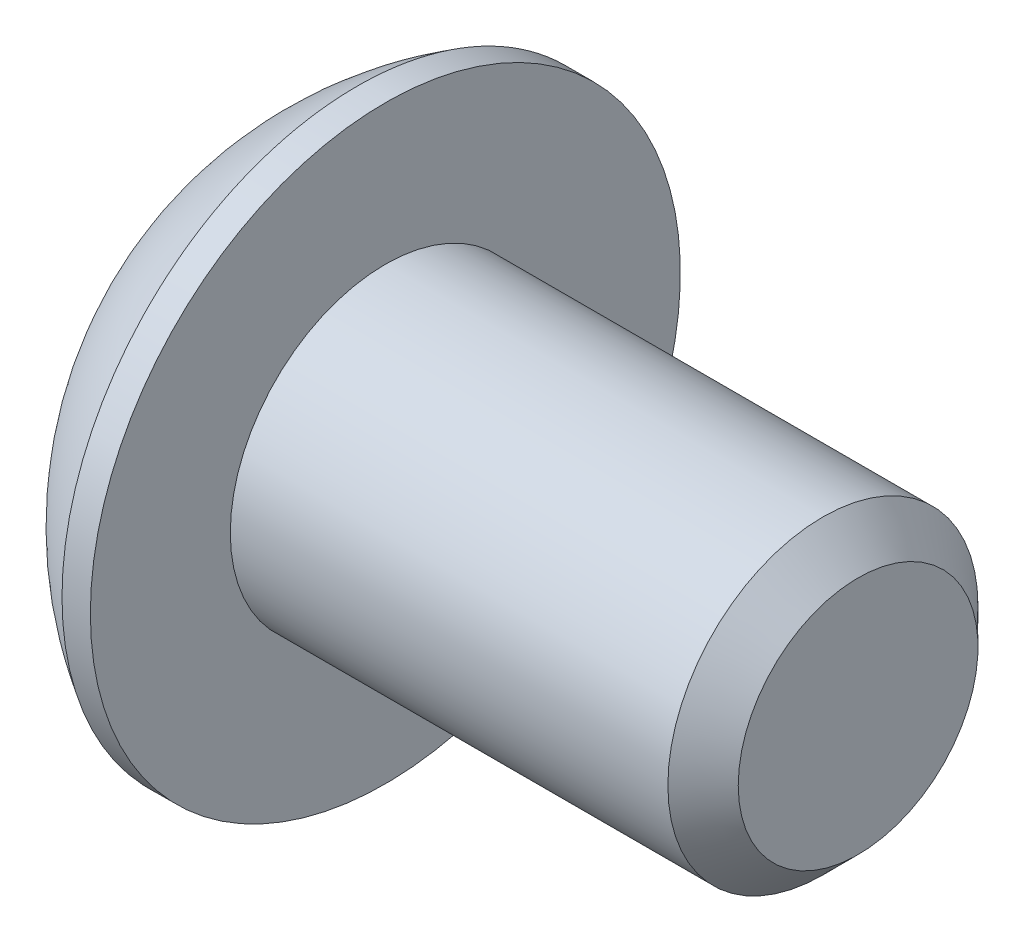
ISO-10303-21;
HEADER;
FILE_DESCRIPTION(('STEP AP214'),'2;1');
FILE_NAME('part.step','',(''),(''),'','','');
FILE_SCHEMA(('AUTOMOTIVE_DESIGN { 1 0 10303 214 1 1 1 1 }'));
ENDSEC;
DATA;
#1=APPLICATION_CONTEXT('core data for automotive mechanical design processes');
#2=APPLICATION_PROTOCOL_DEFINITION('international standard','automotive_design',2000,#1);
#3=PRODUCT_CONTEXT('',#1,'mechanical');
#4=PRODUCT('Part','Part','',(#3));
#5=PRODUCT_RELATED_PRODUCT_CATEGORY('part','',(#4));
#6=PRODUCT_DEFINITION_FORMATION('','',#4);
#7=PRODUCT_DEFINITION_CONTEXT('part definition',#1,'design');
#8=PRODUCT_DEFINITION('design','',#6,#7);
#9=PRODUCT_DEFINITION_SHAPE('','',#8);
#10=(LENGTH_UNIT() NAMED_UNIT(*) SI_UNIT(.MILLI.,.METRE.));
#11=(NAMED_UNIT(*) PLANE_ANGLE_UNIT() SI_UNIT($,.RADIAN.));
#12=(NAMED_UNIT(*) SI_UNIT($,.STERADIAN.) SOLID_ANGLE_UNIT());
#13=UNCERTAINTY_MEASURE_WITH_UNIT(LENGTH_MEASURE(1.E-05),#10,'distance_accuracy_value','');
#14=(GEOMETRIC_REPRESENTATION_CONTEXT(3) GLOBAL_UNCERTAINTY_ASSIGNED_CONTEXT((#13)) GLOBAL_UNIT_ASSIGNED_CONTEXT((#10,
#11,#12)) REPRESENTATION_CONTEXT('',''));
#15=CARTESIAN_POINT('',(0.,0.,0.));
#16=DIRECTION('',(0.,0.,1.));
#17=DIRECTION('',(1.,0.,0.));
#18=AXIS2_PLACEMENT_3D('',#15,#16,#17);
#19=CARTESIAN_POINT('',(1.32080000000034,0.,0.));
#20=DIRECTION('',(-1.,0.,0.));
#21=DIRECTION('',(0.,0.,1.));
#22=AXIS2_PLACEMENT_3D('',#19,#20,#21);
#23=CONICAL_SURFACE('',#22,1.1937999999998,1.04719755119608);
#24=CARTESIAN_POINT('',(2.01004075135902,0.,4.44089209850063E-13));
#25=VERTEX_POINT('',#24);
#26=VERTEX_LOOP('',#25);
#27=FACE_BOUND('',#26,.T.);
#28=CARTESIAN_POINT('',(1.32080000000009,0.,0.));
#29=DIRECTION('',(-1.,0.,0.));
#30=DIRECTION('',(0.,0.,1.));
#31=AXIS2_PLACEMENT_3D('',#28,#29,#30);
#32=CIRCLE('',#31,1.19380000000024);
#33=CARTESIAN_POINT('',(1.32080000000004,-1.03386112703797,0.59690000000006));
#34=VERTEX_POINT('',#33);
#35=CARTESIAN_POINT('',(1.32080000000004,0.,1.19380000000012));
#36=VERTEX_POINT('',#35);
#37=EDGE_CURVE('E18',#34,#36,#32,.T.);
#38=ORIENTED_EDGE('',*,*,#37,.T.);
#39=CARTESIAN_POINT('',(1.32080000000009,0.,0.));
#40=DIRECTION('',(-1.,0.,0.));
#41=DIRECTION('',(0.,0.,1.));
#42=AXIS2_PLACEMENT_3D('',#39,#40,#41);
#43=CIRCLE('',#42,1.19380000000024);
#44=CARTESIAN_POINT('',(1.32080000000004,1.03386112703797,0.596900000000061));
#45=VERTEX_POINT('',#44);
#46=EDGE_CURVE('E139',#36,#45,#43,.T.);
#47=ORIENTED_EDGE('',*,*,#46,.T.);
#48=CARTESIAN_POINT('',(1.32080000000009,0.,0.));
#49=DIRECTION('',(-1.,0.,0.));
#50=DIRECTION('',(0.,0.,1.));
#51=AXIS2_PLACEMENT_3D('',#48,#49,#50);
#52=CIRCLE('',#51,1.19380000000024);
#53=CARTESIAN_POINT('',(1.32080000000004,1.03386112703797,-0.596900000000061));
#54=VERTEX_POINT('',#53);
#55=EDGE_CURVE('E268',#45,#54,#52,.T.);
#56=ORIENTED_EDGE('',*,*,#55,.T.);
#57=CARTESIAN_POINT('',(1.32080000000009,0.,0.));
#58=DIRECTION('',(-1.,0.,0.));
#59=DIRECTION('',(0.,0.,1.));
#60=AXIS2_PLACEMENT_3D('',#57,#58,#59);
#61=CIRCLE('',#60,1.19380000000024);
#62=CARTESIAN_POINT('',(1.32080000000004,1.49457637585666E-12,-1.19380000000012));
#63=VERTEX_POINT('',#62);
#64=EDGE_CURVE('E266',#54,#63,#61,.T.);
#65=ORIENTED_EDGE('',*,*,#64,.T.);
#66=CARTESIAN_POINT('',(1.32080000000009,0.,0.));
#67=DIRECTION('',(-1.,0.,0.));
#68=DIRECTION('',(0.,0.,1.));
#69=AXIS2_PLACEMENT_3D('',#66,#67,#68);
#70=CIRCLE('',#69,1.19380000000024);
#71=CARTESIAN_POINT('',(1.32080000000004,-1.03386112703797,-0.59690000000006));
#72=VERTEX_POINT('',#71);
#73=EDGE_CURVE('E91',#63,#72,#70,.T.);
#74=ORIENTED_EDGE('',*,*,#73,.T.);
#75=CARTESIAN_POINT('',(1.32080000000009,0.,0.));
#76=DIRECTION('',(-1.,0.,0.));
#77=DIRECTION('',(0.,0.,1.));
#78=AXIS2_PLACEMENT_3D('',#75,#76,#77);
#79=CIRCLE('',#78,1.19380000000024);
#80=EDGE_CURVE('E87',#72,#34,#79,.T.);
#81=ORIENTED_EDGE('',*,*,#80,.T.);
#82=EDGE_LOOP('',(#38,#47,#56,#65,#74,#81));
#83=FACE_BOUND('',#82,.T.);
#84=ADVANCED_FACE('F14',(#27,#83),#23,.F.);
#85=CARTESIAN_POINT('',(1.3208,-2.06772225407572,-1.1938));
#86=DIRECTION('',(1.,0.,0.));
#87=DIRECTION('',(0.,0.,-1.));
#88=AXIS2_PLACEMENT_3D('',#85,#86,#87);
#89=PLANE('',#88);
#90=DIRECTION('',(0.,0.5,0.866025403784439));
#91=VECTOR('',#90,1.);
#92=CARTESIAN_POINT('',(1.3208,-1.37848150271715,0.));
#93=LINE('',#92,#91);
#94=CARTESIAN_POINT('',(1.3208,-0.689240751358574,1.1938));
#95=VERTEX_POINT('',#94);
#96=EDGE_CURVE('E99',#95,#34,#93,.F.);
#97=ORIENTED_EDGE('',*,*,#96,.F.);
#98=DIRECTION('',(0.,1.,0.));
#99=VECTOR('',#98,1.);
#100=CARTESIAN_POINT('',(1.3208,-0.689240751358574,1.1938));
#101=LINE('',#100,#99);
#102=EDGE_CURVE('E101',#36,#95,#101,.F.);
#103=ORIENTED_EDGE('',*,*,#102,.F.);
#104=ORIENTED_EDGE('',*,*,#37,.F.);
#105=EDGE_LOOP('',(#97,#103,#104));
#106=FACE_BOUND('',#105,.T.);
#107=ADVANCED_FACE('F97',(#106),#89,.F.);
#108=CARTESIAN_POINT('',(1.3208,-2.06772225407572,-1.1938));
#109=DIRECTION('',(1.,0.,0.));
#110=DIRECTION('',(0.,0.,-1.));
#111=AXIS2_PLACEMENT_3D('',#108,#109,#110);
#112=PLANE('',#111);
#113=DIRECTION('',(0.,-0.5,0.866025403784439));
#114=VECTOR('',#113,1.);
#115=CARTESIAN_POINT('',(1.3208,-0.689240751358574,-1.1938));
#116=LINE('',#115,#114);
#117=CARTESIAN_POINT('',(1.3208,-1.37848150271715,0.));
#118=VERTEX_POINT('',#117);
#119=EDGE_CURVE('E107',#118,#72,#116,.F.);
#120=ORIENTED_EDGE('',*,*,#119,.F.);
#121=DIRECTION('',(0.,0.5,0.866025403784439));
#122=VECTOR('',#121,1.);
#123=CARTESIAN_POINT('',(1.3208,-1.37848150271715,0.));
#124=LINE('',#123,#122);
#125=EDGE_CURVE('E104',#34,#118,#124,.F.);
#126=ORIENTED_EDGE('',*,*,#125,.F.);
#127=ORIENTED_EDGE('',*,*,#80,.F.);
#128=EDGE_LOOP('',(#120,#126,#127));
#129=FACE_BOUND('',#128,.T.);
#130=ADVANCED_FACE('F105',(#129),#112,.F.);
#131=CARTESIAN_POINT('',(1.3208,-2.06772225407572,-1.1938));
#132=DIRECTION('',(1.,0.,0.));
#133=DIRECTION('',(0.,0.,-1.));
#134=AXIS2_PLACEMENT_3D('',#131,#132,#133);
#135=PLANE('',#134);
#136=DIRECTION('',(0.,1.,0.));
#137=VECTOR('',#136,1.);
#138=CARTESIAN_POINT('',(1.3208,0.689240751358577,-1.1938));
#139=LINE('',#138,#137);
#140=CARTESIAN_POINT('',(1.3208,-0.689240751358574,-1.1938));
#141=VERTEX_POINT('',#140);
#142=EDGE_CURVE('E235',#141,#63,#139,.T.);
#143=ORIENTED_EDGE('',*,*,#142,.F.);
#144=DIRECTION('',(0.,-0.5,0.866025403784439));
#145=VECTOR('',#144,1.);
#146=CARTESIAN_POINT('',(1.3208,-0.689240751358574,-1.1938));
#147=LINE('',#146,#145);
#148=EDGE_CURVE('E240',#72,#141,#147,.F.);
#149=ORIENTED_EDGE('',*,*,#148,.F.);
#150=ORIENTED_EDGE('',*,*,#73,.F.);
#151=EDGE_LOOP('',(#143,#149,#150));
#152=FACE_BOUND('',#151,.T.);
#153=ADVANCED_FACE('F182',(#152),#135,.F.);
#154=CARTESIAN_POINT('',(1.3208,-2.06772225407572,-1.1938));
#155=DIRECTION('',(1.,0.,0.));
#156=DIRECTION('',(0.,0.,-1.));
#157=AXIS2_PLACEMENT_3D('',#154,#155,#156);
#158=PLANE('',#157);
#159=DIRECTION('',(0.,-0.5,-0.866025403784439));
#160=VECTOR('',#159,1.);
#161=CARTESIAN_POINT('',(1.3208,1.37848150271715,0.));
#162=LINE('',#161,#160);
#163=CARTESIAN_POINT('',(1.3208,0.689240751358577,-1.1938));
#164=VERTEX_POINT('',#163);
#165=EDGE_CURVE('E226',#164,#54,#162,.F.);
#166=ORIENTED_EDGE('',*,*,#165,.F.);
#167=DIRECTION('',(0.,1.,0.));
#168=VECTOR('',#167,1.);
#169=CARTESIAN_POINT('',(1.3208,0.689240751358577,-1.1938));
#170=LINE('',#169,#168);
#171=EDGE_CURVE('E232',#63,#164,#170,.T.);
#172=ORIENTED_EDGE('',*,*,#171,.F.);
#173=ORIENTED_EDGE('',*,*,#64,.F.);
#174=EDGE_LOOP('',(#166,#172,#173));
#175=FACE_BOUND('',#174,.T.);
#176=ADVANCED_FACE('F178',(#175),#158,.F.);
#177=CARTESIAN_POINT('',(1.3208,-2.06772225407572,-1.1938));
#178=DIRECTION('',(1.,0.,0.));
#179=DIRECTION('',(0.,0.,-1.));
#180=AXIS2_PLACEMENT_3D('',#177,#178,#179);
#181=PLANE('',#180);
#182=DIRECTION('',(0.,0.5,-0.866025403784439));
#183=VECTOR('',#182,1.);
#184=CARTESIAN_POINT('',(1.3208,0.689240751358576,1.1938));
#185=LINE('',#184,#183);
#186=CARTESIAN_POINT('',(1.3208,1.37848150271715,0.));
#187=VERTEX_POINT('',#186);
#188=EDGE_CURVE('E213',#187,#45,#185,.F.);
#189=ORIENTED_EDGE('',*,*,#188,.F.);
#190=DIRECTION('',(0.,-0.5,-0.866025403784439));
#191=VECTOR('',#190,1.);
#192=CARTESIAN_POINT('',(1.3208,1.37848150271715,0.));
#193=LINE('',#192,#191);
#194=EDGE_CURVE('E224',#54,#187,#193,.F.);
#195=ORIENTED_EDGE('',*,*,#194,.F.);
#196=ORIENTED_EDGE('',*,*,#55,.F.);
#197=EDGE_LOOP('',(#189,#195,#196));
#198=FACE_BOUND('',#197,.T.);
#199=ADVANCED_FACE('F174',(#198),#181,.F.);
#200=CARTESIAN_POINT('',(1.3208,-2.06772225407572,-1.1938));
#201=DIRECTION('',(1.,0.,0.));
#202=DIRECTION('',(0.,0.,-1.));
#203=AXIS2_PLACEMENT_3D('',#200,#201,#202);
#204=PLANE('',#203);
#205=DIRECTION('',(0.,1.,0.));
#206=VECTOR('',#205,1.);
#207=CARTESIAN_POINT('',(1.3208,-0.689240751358574,1.1938));
#208=LINE('',#207,#206);
#209=CARTESIAN_POINT('',(1.3208,0.689240751358576,1.1938));
#210=VERTEX_POINT('',#209);
#211=EDGE_CURVE('E116',#210,#36,#208,.F.);
#212=ORIENTED_EDGE('',*,*,#211,.F.);
#213=DIRECTION('',(0.,0.5,-0.866025403784439));
#214=VECTOR('',#213,1.);
#215=CARTESIAN_POINT('',(1.3208,0.689240751358576,1.1938));
#216=LINE('',#215,#214);
#217=EDGE_CURVE('E216',#45,#210,#216,.F.);
#218=ORIENTED_EDGE('',*,*,#217,.F.);
#219=ORIENTED_EDGE('',*,*,#46,.F.);
#220=EDGE_LOOP('',(#212,#218,#219));
#221=FACE_BOUND('',#220,.T.);
#222=ADVANCED_FACE('F170',(#221),#204,.F.);
#223=CARTESIAN_POINT('',(1.3208,-0.689240751358574,1.1938));
#224=DIRECTION('',(0.,0.,-1.));
#225=DIRECTION('',(0.,1.,0.));
#226=AXIS2_PLACEMENT_3D('',#223,#224,#225);
#227=PLANE('',#226);
#228=DIRECTION('',(0.,1.,0.));
#229=VECTOR('',#228,1.);
#230=CARTESIAN_POINT('',(0.,0.,1.1938));
#231=LINE('',#230,#229);
#232=CARTESIAN_POINT('',(0.,0.689240751358577,1.1938));
#233=VERTEX_POINT('',#232);
#234=CARTESIAN_POINT('',(0.,-0.689240751358574,1.1938));
#235=VERTEX_POINT('',#234);
#236=EDGE_CURVE('E228',#233,#235,#231,.F.);
#237=ORIENTED_EDGE('',*,*,#236,.F.);
#238=DIRECTION('',(1.,0.,0.));
#239=VECTOR('',#238,1.);
#240=CARTESIAN_POINT('',(1.3208,0.689240751358576,1.1938));
#241=LINE('',#240,#239);
#242=EDGE_CURVE('E220',#210,#233,#241,.F.);
#243=ORIENTED_EDGE('',*,*,#242,.F.);
#244=ORIENTED_EDGE('',*,*,#211,.T.);
#245=ORIENTED_EDGE('',*,*,#102,.T.);
#246=DIRECTION('',(1.,0.,0.));
#247=VECTOR('',#246,1.);
#248=CARTESIAN_POINT('',(1.3208,-0.689240751358574,1.1938));
#249=LINE('',#248,#247);
#250=EDGE_CURVE('E110',#235,#95,#249,.T.);
#251=ORIENTED_EDGE('',*,*,#250,.F.);
#252=EDGE_LOOP('',(#237,#243,#244,#245,#251));
#253=FACE_BOUND('',#252,.T.);
#254=ADVANCED_FACE('F167',(#253),#227,.T.);
#255=CARTESIAN_POINT('',(1.3208,-1.37848150271715,0.));
#256=DIRECTION('',(0.,0.866025403784439,-0.5));
#257=DIRECTION('',(0.,0.5,0.866025403784439));
#258=AXIS2_PLACEMENT_3D('',#255,#256,#257);
#259=PLANE('',#258);
#260=DIRECTION('',(0.,-0.5,-0.866025403784439));
#261=VECTOR('',#260,1.);
#262=CARTESIAN_POINT('',(0.,-0.689240751358574,1.1938));
#263=LINE('',#262,#261);
#264=CARTESIAN_POINT('',(0.,-1.37848150271715,0.));
#265=VERTEX_POINT('',#264);
#266=EDGE_CURVE('E249',#235,#265,#263,.T.);
#267=ORIENTED_EDGE('',*,*,#266,.F.);
#268=ORIENTED_EDGE('',*,*,#250,.T.);
#269=ORIENTED_EDGE('',*,*,#96,.T.);
#270=ORIENTED_EDGE('',*,*,#125,.T.);
#271=DIRECTION('',(1.,0.,0.));
#272=VECTOR('',#271,1.);
#273=CARTESIAN_POINT('',(1.3208,-1.37848150271715,0.));
#274=LINE('',#273,#272);
#275=EDGE_CURVE('E119',#265,#118,#274,.T.);
#276=ORIENTED_EDGE('',*,*,#275,.F.);
#277=EDGE_LOOP('',(#267,#268,#269,#270,#276));
#278=FACE_BOUND('',#277,.T.);
#279=ADVANCED_FACE('F114',(#278),#259,.T.);
#280=CARTESIAN_POINT('',(1.3208,-0.689240751358574,-1.1938));
#281=DIRECTION('',(0.,0.866025403784439,0.5));
#282=DIRECTION('',(0.,-0.5,0.866025403784439));
#283=AXIS2_PLACEMENT_3D('',#280,#281,#282);
#284=PLANE('',#283);
#285=DIRECTION('',(0.,0.5,-0.866025403784439));
#286=VECTOR('',#285,1.);
#287=CARTESIAN_POINT('',(0.,-1.37848150271715,0.));
#288=LINE('',#287,#286);
#289=CARTESIAN_POINT('',(0.,-0.689240751358574,-1.1938));
#290=VERTEX_POINT('',#289);
#291=EDGE_CURVE('E247',#265,#290,#288,.T.);
#292=ORIENTED_EDGE('',*,*,#291,.F.);
#293=ORIENTED_EDGE('',*,*,#275,.T.);
#294=ORIENTED_EDGE('',*,*,#119,.T.);
#295=ORIENTED_EDGE('',*,*,#148,.T.);
#296=DIRECTION('',(1.,0.,0.));
#297=VECTOR('',#296,1.);
#298=CARTESIAN_POINT('',(1.3208,-0.689240751358574,-1.1938));
#299=LINE('',#298,#297);
#300=EDGE_CURVE('E231',#290,#141,#299,.T.);
#301=ORIENTED_EDGE('',*,*,#300,.F.);
#302=EDGE_LOOP('',(#292,#293,#294,#295,#301));
#303=FACE_BOUND('',#302,.T.);
#304=ADVANCED_FACE('F160',(#303),#284,.T.);
#305=CARTESIAN_POINT('',(1.3208,0.689240751358577,-1.1938));
#306=DIRECTION('',(0.,0.,1.));
#307=DIRECTION('',(1.,0.,0.));
#308=AXIS2_PLACEMENT_3D('',#305,#306,#307);
#309=PLANE('',#308);
#310=DIRECTION('',(0.,1.,0.));
#311=VECTOR('',#310,1.);
#312=CARTESIAN_POINT('',(0.,0.,-1.1938));
#313=LINE('',#312,#311);
#314=CARTESIAN_POINT('',(0.,0.689240751358577,-1.1938));
#315=VERTEX_POINT('',#314);
#316=EDGE_CURVE('E258',#290,#315,#313,.T.);
#317=ORIENTED_EDGE('',*,*,#316,.F.);
#318=ORIENTED_EDGE('',*,*,#300,.T.);
#319=ORIENTED_EDGE('',*,*,#142,.T.);
#320=ORIENTED_EDGE('',*,*,#171,.T.);
#321=DIRECTION('',(1.,0.,0.));
#322=VECTOR('',#321,1.);
#323=CARTESIAN_POINT('',(1.3208,0.689240751358577,-1.1938));
#324=LINE('',#323,#322);
#325=EDGE_CURVE('E217',#315,#164,#324,.T.);
#326=ORIENTED_EDGE('',*,*,#325,.F.);
#327=EDGE_LOOP('',(#317,#318,#319,#320,#326));
#328=FACE_BOUND('',#327,.T.);
#329=ADVANCED_FACE('F157',(#328),#309,.T.);
#330=CARTESIAN_POINT('',(1.3208,1.37848150271715,0.));
#331=DIRECTION('',(0.,-0.866025403784439,0.5));
#332=DIRECTION('',(0.,-0.5,-0.866025403784439));
#333=AXIS2_PLACEMENT_3D('',#330,#331,#332);
#334=PLANE('',#333);
#335=DIRECTION('',(0.,0.5,0.866025403784439));
#336=VECTOR('',#335,1.);
#337=CARTESIAN_POINT('',(0.,0.689240751358577,-1.1938));
#338=LINE('',#337,#336);
#339=CARTESIAN_POINT('',(0.,1.37848150271715,0.));
#340=VERTEX_POINT('',#339);
#341=EDGE_CURVE('E261',#315,#340,#338,.T.);
#342=ORIENTED_EDGE('',*,*,#341,.F.);
#343=ORIENTED_EDGE('',*,*,#325,.T.);
#344=ORIENTED_EDGE('',*,*,#165,.T.);
#345=ORIENTED_EDGE('',*,*,#194,.T.);
#346=DIRECTION('',(1.,0.,0.));
#347=VECTOR('',#346,1.);
#348=CARTESIAN_POINT('',(1.3208,1.37848150271715,0.));
#349=LINE('',#348,#347);
#350=EDGE_CURVE('E33',#340,#187,#349,.T.);
#351=ORIENTED_EDGE('',*,*,#350,.F.);
#352=EDGE_LOOP('',(#342,#343,#344,#345,#351));
#353=FACE_BOUND('',#352,.T.);
#354=ADVANCED_FACE('F153',(#353),#334,.T.);
#355=CARTESIAN_POINT('',(1.3208,0.689240751358576,1.1938));
#356=DIRECTION('',(0.,-0.866025403784439,-0.5));
#357=DIRECTION('',(0.,0.5,-0.866025403784439));
#358=AXIS2_PLACEMENT_3D('',#355,#356,#357);
#359=PLANE('',#358);
#360=DIRECTION('',(0.,-0.5,0.866025403784439));
#361=VECTOR('',#360,1.);
#362=CARTESIAN_POINT('',(0.,1.37848150271715,0.));
#363=LINE('',#362,#361);
#364=EDGE_CURVE('E138',#340,#233,#363,.T.);
#365=ORIENTED_EDGE('',*,*,#364,.F.);
#366=ORIENTED_EDGE('',*,*,#350,.T.);
#367=ORIENTED_EDGE('',*,*,#188,.T.);
#368=ORIENTED_EDGE('',*,*,#217,.T.);
#369=ORIENTED_EDGE('',*,*,#242,.T.);
#370=EDGE_LOOP('',(#365,#366,#367,#368,#369));
#371=FACE_BOUND('',#370,.T.);
#372=ADVANCED_FACE('F149',(#371),#359,.T.);
#373=CARTESIAN_POINT('',(0.,0.,0.));
#374=DIRECTION('',(-1.,0.,0.));
#375=DIRECTION('',(0.,0.,1.));
#376=AXIS2_PLACEMENT_3D('',#373,#374,#375);
#377=PLANE('',#376);
#378=ORIENTED_EDGE('',*,*,#341,.T.);
#379=ORIENTED_EDGE('',*,*,#364,.T.);
#380=ORIENTED_EDGE('',*,*,#236,.T.);
#381=ORIENTED_EDGE('',*,*,#266,.T.);
#382=ORIENTED_EDGE('',*,*,#291,.T.);
#383=ORIENTED_EDGE('',*,*,#316,.T.);
#384=EDGE_LOOP('',(#378,#379,#380,#381,#382,#383));
#385=FACE_BOUND('',#384,.T.);
#386=CARTESIAN_POINT('',(0.,1.9812,0.));
#387=CARTESIAN_POINT('',(0.,1.9811996664299,0.0556258831179429));
#388=CARTESIAN_POINT('',(0.,1.97885520380442,0.111261989398606));
#389=CARTESIAN_POINT('',(0.,1.96949260169541,0.222149719830458));
#390=CARTESIAN_POINT('',(0.,1.96247308239606,0.277401225602896));
#391=CARTESIAN_POINT('',(0.,1.94379192841039,0.387209508139748));
#392=CARTESIAN_POINT('',(-1.85322098412163E-13,1.93212292489526,0.441765039546366));
#393=CARTESIAN_POINT('',(1.86340516395781E-13,1.90422331175315,0.549729449347493));
#394=CARTESIAN_POINT('',(6.9454338814387E-13,1.88798900035338,0.603137359208869));
#395=CARTESIAN_POINT('',(1.15501971975443E-12,1.832662144765,0.760839131321828));
#396=CARTESIAN_POINT('',(0.,1.78690023648845,0.86287643357543));
#397=CARTESIAN_POINT('',(0.,1.67887358150667,1.05780719540872));
#398=CARTESIAN_POINT('',(9.54252846156157E-13,1.6166082074585,1.15070030720801));
#399=CARTESIAN_POINT('',(5.94775737193293E-13,1.51224157140982,1.28116890915698));
#400=CARTESIAN_POINT('',(1.63135429314554E-13,1.47559703943539,1.32320451127027));
#401=CARTESIAN_POINT('',(-1.62111198585679E-13,1.39893832619713,1.40400288695709));
#402=CARTESIAN_POINT('',(0.,1.35892742784698,1.44276877695455));
#403=CARTESIAN_POINT('',(1.13736409396491E-13,1.23416504602197,1.55382272417904));
#404=CARTESIAN_POINT('',(0.,1.14466125559859,1.62089527952111));
#405=CARTESIAN_POINT('',(0.,0.955712144178161,1.73902218081179));
#406=CARTESIAN_POINT('',(0.,0.856267198233561,1.79007713076008));
#407=CARTESIAN_POINT('',(0.,0.65020634591084,1.87477637530954));
#408=CARTESIAN_POINT('',(0.,0.543590516134851,1.90842085586266));
#409=CARTESIAN_POINT('',(0.,0.326226155292014,1.95733039300656));
#410=CARTESIAN_POINT('',(0.,0.215477602157926,1.97259535144288));
#411=CARTESIAN_POINT('',(0.,-0.00701040587545002,1.98431697865418));
#412=CARTESIAN_POINT('',(0.,-0.118749860774737,1.98077364742916));
#413=CARTESIAN_POINT('',(0.,-0.340050178355489,1.95497485623824));
#414=CARTESIAN_POINT('',(0.,-0.449611052668259,1.93271949620217));
#415=CARTESIAN_POINT('',(0.,-0.663431110729177,1.87014138774524));
#416=CARTESIAN_POINT('',(0.,-0.767690237838523,1.82981844635272));
#417=CARTESIAN_POINT('',(0.,-0.968005760719348,1.73219968377096));
#418=CARTESIAN_POINT('',(0.,-1.0640618469811,1.6749032225164));
#419=CARTESIAN_POINT('',(0.,-1.19980276751283,1.57757371205873));
#420=CARTESIAN_POINT('',(0.,-1.24366557129214,1.54322665019466));
#421=CARTESIAN_POINT('',(0.,-1.32838995706696,1.47093063174264));
#422=CARTESIAN_POINT('',(0.,-1.36924860178706,1.43297823102439));
#423=CARTESIAN_POINT('',(0.,-1.48674671849223,1.31419842051172));
#424=CARTESIAN_POINT('',(0.,-1.55842832343237,1.22836221289311));
#425=CARTESIAN_POINT('',(0.,-1.6863396856475,1.04586168272493));
#426=CARTESIAN_POINT('',(0.,-1.7425700302488,0.949197771949769));
#427=CARTESIAN_POINT('',(0.,-1.8141614250401,0.798182600298679));
#428=CARTESIAN_POINT('',(0.,-1.83591780585875,0.746776203847787));
#429=CARTESIAN_POINT('',(0.,-1.87500754181092,0.642341081688632));
#430=CARTESIAN_POINT('',(0.,-1.89234447645404,0.589313708122843));
#431=CARTESIAN_POINT('',(0.,-1.92246053433555,0.482076273028391));
#432=CARTESIAN_POINT('',(0.,-1.93524685475118,0.427868224257506));
#433=CARTESIAN_POINT('',(0.,-1.95620937250494,0.318578151844607));
#434=CARTESIAN_POINT('',(0.,-1.96438692958147,0.263496390912868));
#435=CARTESIAN_POINT('',(0.,-1.97388528284653,0.173607715038555));
#436=CARTESIAN_POINT('',(0.,-1.97662743364426,0.138944718024995));
#437=CARTESIAN_POINT('',(0.,-1.98028489645283,0.069522478256699));
#438=CARTESIAN_POINT('',(0.,-1.98120020846367,0.0347632355019625));
#439=CARTESIAN_POINT('',(0.,-1.9811996664299,-0.0556258831179437));
#440=CARTESIAN_POINT('',(0.,-1.97885520380442,-0.111261989398607));
#441=CARTESIAN_POINT('',(0.,-1.96949260169541,-0.222149719830459));
#442=CARTESIAN_POINT('',(0.,-1.96247308239605,-0.277401225602897));
#443=CARTESIAN_POINT('',(0.,-1.94379192841039,-0.387209508139749));
#444=CARTESIAN_POINT('',(-1.85273829369933E-13,-1.93212292489526,-0.441765039546367));
#445=CARTESIAN_POINT('',(1.86292208101257E-13,-1.90422331175315,-0.549729449347495));
#446=CARTESIAN_POINT('',(6.94526512411752E-13,-1.88798900035338,-0.603137359208872));
#447=CARTESIAN_POINT('',(1.15505339077404E-12,-1.83266214476501,-0.760839131321831));
#448=CARTESIAN_POINT('',(0.,-1.78690023648846,-0.862876433575432));
#449=CARTESIAN_POINT('',(0.,-1.67887358150667,-1.05780719540872));
#450=CARTESIAN_POINT('',(9.54248949793369E-13,-1.6166082074585,-1.15070030720801));
#451=CARTESIAN_POINT('',(5.94777687927534E-13,-1.51224157140982,-1.28116890915698));
#452=CARTESIAN_POINT('',(1.63138929838936E-13,-1.4755970394354,-1.32320451127027));
#453=CARTESIAN_POINT('',(-1.62114695735028E-13,-1.39893832619713,-1.40400288695709));
#454=CARTESIAN_POINT('',(0.,-1.35892742784699,-1.44276877695455));
#455=CARTESIAN_POINT('',(1.13760471433616E-13,-1.23416504602197,-1.55382272417904));
#456=CARTESIAN_POINT('',(0.,-1.14466125559859,-1.62089527952111));
#457=CARTESIAN_POINT('',(0.,-0.95571214417816,-1.73902218081179));
#458=CARTESIAN_POINT('',(0.,-0.856267198233559,-1.79007713076007));
#459=CARTESIAN_POINT('',(0.,-0.650206345910841,-1.87477637530954));
#460=CARTESIAN_POINT('',(0.,-0.543590516134854,-1.90842085586267));
#461=CARTESIAN_POINT('',(0.,-0.326226155292018,-1.95733039300657));
#462=CARTESIAN_POINT('',(0.,-0.215477602157928,-1.97259535144288));
#463=CARTESIAN_POINT('',(0.,0.00701040587544881,-1.98431697865418));
#464=CARTESIAN_POINT('',(0.,0.118749860774737,-1.98077364742916));
#465=CARTESIAN_POINT('',(0.,0.340050178355489,-1.95497485623824));
#466=CARTESIAN_POINT('',(0.,0.44961105266826,-1.93271949620218));
#467=CARTESIAN_POINT('',(0.,0.663431110729178,-1.87014138774524));
#468=CARTESIAN_POINT('',(0.,0.767690237838524,-1.82981844635272));
#469=CARTESIAN_POINT('',(0.,0.968005760719347,-1.73219968377096));
#470=CARTESIAN_POINT('',(0.,1.0640618469811,-1.67490322251639));
#471=CARTESIAN_POINT('',(0.,1.19980276751283,-1.57757371205873));
#472=CARTESIAN_POINT('',(0.,1.24366557129214,-1.54322665019465));
#473=CARTESIAN_POINT('',(0.,1.32838995706696,-1.47093063174263));
#474=CARTESIAN_POINT('',(0.,1.36924860178706,-1.43297823102439));
#475=CARTESIAN_POINT('',(0.,1.48674671849223,-1.31419842051172));
#476=CARTESIAN_POINT('',(0.,1.55842832343237,-1.22836221289311));
#477=CARTESIAN_POINT('',(0.,1.6863396856475,-1.04586168272493));
#478=CARTESIAN_POINT('',(0.,1.7425700302488,-0.94919777194977));
#479=CARTESIAN_POINT('',(0.,1.8141614250401,-0.798182600298679));
#480=CARTESIAN_POINT('',(0.,1.83591780585875,-0.746776203847786));
#481=CARTESIAN_POINT('',(0.,1.87500754181092,-0.642341081688631));
#482=CARTESIAN_POINT('',(0.,1.89234447645404,-0.589313708122842));
#483=CARTESIAN_POINT('',(0.,1.92246053433555,-0.482076273028391));
#484=CARTESIAN_POINT('',(0.,1.93524685475118,-0.427868224257506));
#485=CARTESIAN_POINT('',(0.,1.95620937250494,-0.318578151844607));
#486=CARTESIAN_POINT('',(0.,1.96438692958147,-0.263496390912867));
#487=CARTESIAN_POINT('',(0.,1.97388528284653,-0.173607715038554));
#488=CARTESIAN_POINT('',(0.,1.97662743364426,-0.138944718024995));
#489=CARTESIAN_POINT('',(0.,1.98028489645283,-0.0695224782566994));
#490=CARTESIAN_POINT('',(0.,1.98120020846367,-0.0347632355019633));
#491=CARTESIAN_POINT('',(0.,1.9812,0.));
#492=B_SPLINE_CURVE_WITH_KNOTS('',3,(#386,#387,#388,#389,#390,#391,#392,#393,#394,#395,#396,
#397,#398,#399,#400,#401,#402,#403,#404,#405,#406,#407,#408,#409,#410,#411,#412,#413,#414,#415,
#416,#417,#418,#419,#420,#421,#422,#423,#424,#425,#426,#427,#428,#429,#430,#431,#432,#433,#434,
#435,#436,#437,#438,#439,#440,#441,#442,#443,#444,#445,#446,#447,#448,#449,#450,#451,#452,#453,
#454,#455,#456,#457,#458,#459,#460,#461,#462,#463,#464,#465,#466,#467,#468,#469,#470,#471,#472,
#473,#474,#475,#476,#477,#478,#479,#480,#481,#482,#483,#484,#485,#486,#487,#488,#489,#490,#491),
.UNSPECIFIED.,.T.,.F.,(4,2,2,2,2,2,2,2,2,2,2,2,2,2,2,2,2,2,2,2,2,2,2,2,2,2,2,2,2,2,2,2,2,2,2,2,
2,2,2,2,2,2,2,2,2,2,2,2,2,2,2,2,4),(0.,0.166845646007828,0.333740557374256,0.500901034367694,
0.668197445942387,1.00199278686282,1.33580081809885,1.50292354032982,1.6698851310853,
2.00370118900129,2.33750465770544,2.67130456115909,3.00510624723801,3.33890793331696,
3.67270783677065,4.00651130547476,4.34032736339026,4.50728895414554,4.67441167637632,
5.0082197076126,5.34201504853333,5.50931146010827,5.67647193710192,5.84336684846844,
6.01021249447641,6.11448220058334,6.21875190669029,6.38559755269811,6.55249246406454,
6.71965294105798,6.88694935263267,7.22074469355311,7.55455272478914,7.72167544702011,
7.88863703777559,8.22245309569158,8.55625656439573,8.89005646784938,9.2238581539283,
9.55765984000725,9.89145974346094,10.225263212165,10.5590792700806,10.7260408608358,
10.8931635830666,11.2269716143029,11.5607669552236,11.7280633667986,11.8952238437922,
12.0621187551587,12.2289644011667,12.3332341072736,12.4375038133806),.UNSPECIFIED.);
#493=CARTESIAN_POINT('',(0.,1.9812,0.));
#494=VERTEX_POINT('',#493);
#495=EDGE_CURVE('E131',#494,#494,#492,.T.);
#496=ORIENTED_EDGE('',*,*,#495,.F.);
#497=EDGE_LOOP('',(#496));
#498=FACE_BOUND('',#497,.T.);
#499=ADVANCED_FACE('F145',(#385,#498),#377,.T.);
#500=CARTESIAN_POINT('',(4.13385,0.,0.));
#501=DIRECTION('',(0.,1.,0.));
#502=DIRECTION('',(1.,0.,0.));
#503=AXIS2_PLACEMENT_3D('',#500,#501,#502);
#504=SPHERICAL_SURFACE('',#503,4.58408870578439);
#505=CARTESIAN_POINT('',(1.8288,0.,0.));
#506=DIRECTION('',(-1.,0.,0.));
#507=DIRECTION('',(0.,0.,1.));
#508=AXIS2_PLACEMENT_3D('',#505,#506,#507);
#509=CIRCLE('',#508,3.9624);
#510=CARTESIAN_POINT('',(1.8288,0.,3.9624));
#511=VERTEX_POINT('',#510);
#512=EDGE_CURVE('E128',#511,#511,#509,.F.);
#513=ORIENTED_EDGE('',*,*,#512,.F.);
#514=EDGE_LOOP('',(#513));
#515=FACE_BOUND('',#514,.T.);
#516=ORIENTED_EDGE('',*,*,#495,.T.);
#517=EDGE_LOOP('',(#516));
#518=FACE_BOUND('',#517,.T.);
#519=ADVANCED_FACE('F141',(#515,#518),#504,.T.);
#520=CARTESIAN_POINT('',(8.5598,0.,0.));
#521=DIRECTION('',(-1.,0.,0.));
#522=DIRECTION('',(0.,0.,1.));
#523=AXIS2_PLACEMENT_3D('',#520,#521,#522);
#524=PLANE('',#523);
#525=CARTESIAN_POINT('',(8.55979999994361,0.,0.));
#526=DIRECTION('',(-1.,0.,0.));
#527=DIRECTION('',(0.,0.,1.));
#528=AXIS2_PLACEMENT_3D('',#525,#526,#527);
#529=CIRCLE('',#528,1.61036000002923);
#530=CARTESIAN_POINT('',(8.55979999994361,0.,1.61036000002923));
#531=VERTEX_POINT('',#530);
#532=EDGE_CURVE('E125',#531,#531,#529,.T.);
#533=ORIENTED_EDGE('',*,*,#532,.F.);
#534=EDGE_LOOP('',(#533));
#535=FACE_BOUND('',#534,.T.);
#536=ADVANCED_FACE('F276',(#535),#524,.F.);
#537=CARTESIAN_POINT('',(0.,0.,0.));
#538=DIRECTION('',(-1.,0.,0.));
#539=DIRECTION('',(0.,0.,1.));
#540=AXIS2_PLACEMENT_3D('',#537,#538,#539);
#541=CYLINDRICAL_SURFACE('',#540,3.9624);
#542=ORIENTED_EDGE('',*,*,#512,.T.);
#543=EDGE_LOOP('',(#542));
#544=FACE_BOUND('',#543,.T.);
#545=CARTESIAN_POINT('',(2.2098,0.,0.));
#546=DIRECTION('',(-1.,0.,0.));
#547=DIRECTION('',(0.,0.,1.));
#548=AXIS2_PLACEMENT_3D('',#545,#546,#547);
#549=CIRCLE('',#548,3.9624);
#550=CARTESIAN_POINT('',(2.2098,0.,3.9624));
#551=VERTEX_POINT('',#550);
#552=EDGE_CURVE('E122',#551,#551,#549,.T.);
#553=ORIENTED_EDGE('',*,*,#552,.T.);
#554=EDGE_LOOP('',(#553));
#555=FACE_BOUND('',#554,.T.);
#556=ADVANCED_FACE('F281',(#544,#555),#541,.T.);
#557=CARTESIAN_POINT('',(8.0873599999336,0.,0.));
#558=DIRECTION('',(-1.,0.,0.));
#559=DIRECTION('',(0.,0.,1.));
#560=AXIS2_PLACEMENT_3D('',#557,#558,#559);
#561=CONICAL_SURFACE('',#560,2.08280000003924,0.785398163397448);
#562=CARTESIAN_POINT('',(8.08736,0.,0.));
#563=DIRECTION('',(-1.,0.,0.));
#564=DIRECTION('',(0.,0.,1.));
#565=AXIS2_PLACEMENT_3D('',#562,#563,#564);
#566=CIRCLE('',#565,2.0828);
#567=CARTESIAN_POINT('',(8.08736,0.,2.0828));
#568=VERTEX_POINT('',#567);
#569=EDGE_CURVE('E24',#568,#568,#566,.T.);
#570=ORIENTED_EDGE('',*,*,#569,.F.);
#571=EDGE_LOOP('',(#570));
#572=FACE_BOUND('',#571,.T.);
#573=ORIENTED_EDGE('',*,*,#532,.T.);
#574=EDGE_LOOP('',(#573));
#575=FACE_BOUND('',#574,.T.);
#576=ADVANCED_FACE('F202',(#572,#575),#561,.T.);
#577=CARTESIAN_POINT('',(2.2098,2.0828,0.));
#578=DIRECTION('',(-1.,0.,0.));
#579=DIRECTION('',(0.,0.,1.));
#580=AXIS2_PLACEMENT_3D('',#577,#578,#579);
#581=PLANE('',#580);
#582=CARTESIAN_POINT('',(2.2098,0.,0.));
#583=DIRECTION('',(-1.,0.,0.));
#584=DIRECTION('',(0.,0.,1.));
#585=AXIS2_PLACEMENT_3D('',#582,#583,#584);
#586=CIRCLE('',#585,2.0828);
#587=CARTESIAN_POINT('',(2.2098,0.,2.0828));
#588=VERTEX_POINT('',#587);
#589=EDGE_CURVE('E9',#588,#588,#586,.F.);
#590=ORIENTED_EDGE('',*,*,#589,.F.);
#591=EDGE_LOOP('',(#590));
#592=FACE_BOUND('',#591,.T.);
#593=ORIENTED_EDGE('',*,*,#552,.F.);
#594=EDGE_LOOP('',(#593));
#595=FACE_BOUND('',#594,.T.);
#596=ADVANCED_FACE('F197',(#592,#595),#581,.F.);
#597=CARTESIAN_POINT('',(0.,0.,0.));
#598=DIRECTION('',(-1.,0.,0.));
#599=DIRECTION('',(0.,0.,1.));
#600=AXIS2_PLACEMENT_3D('',#597,#598,#599);
#601=CYLINDRICAL_SURFACE('',#600,2.0828);
#602=ORIENTED_EDGE('',*,*,#589,.T.);
#603=EDGE_LOOP('',(#602));
#604=FACE_BOUND('',#603,.T.);
#605=ORIENTED_EDGE('',*,*,#569,.T.);
#606=EDGE_LOOP('',(#605));
#607=FACE_BOUND('',#606,.T.);
#608=ADVANCED_FACE('F16',(#604,#607),#601,.T.);
#609=CLOSED_SHELL('',(#84,#107,#130,#153,#176,#199,#222,#254,#279,#304,#329,#354,#372,#499,#519,
#536,#556,#576,#596,#608));
#610=MANIFOLD_SOLID_BREP('B1',#609);
#611=ADVANCED_BREP_SHAPE_REPRESENTATION('',(#18,#610),#14);
#612=SHAPE_DEFINITION_REPRESENTATION(#9,#611);
ENDSEC;
END-ISO-10303-21;
